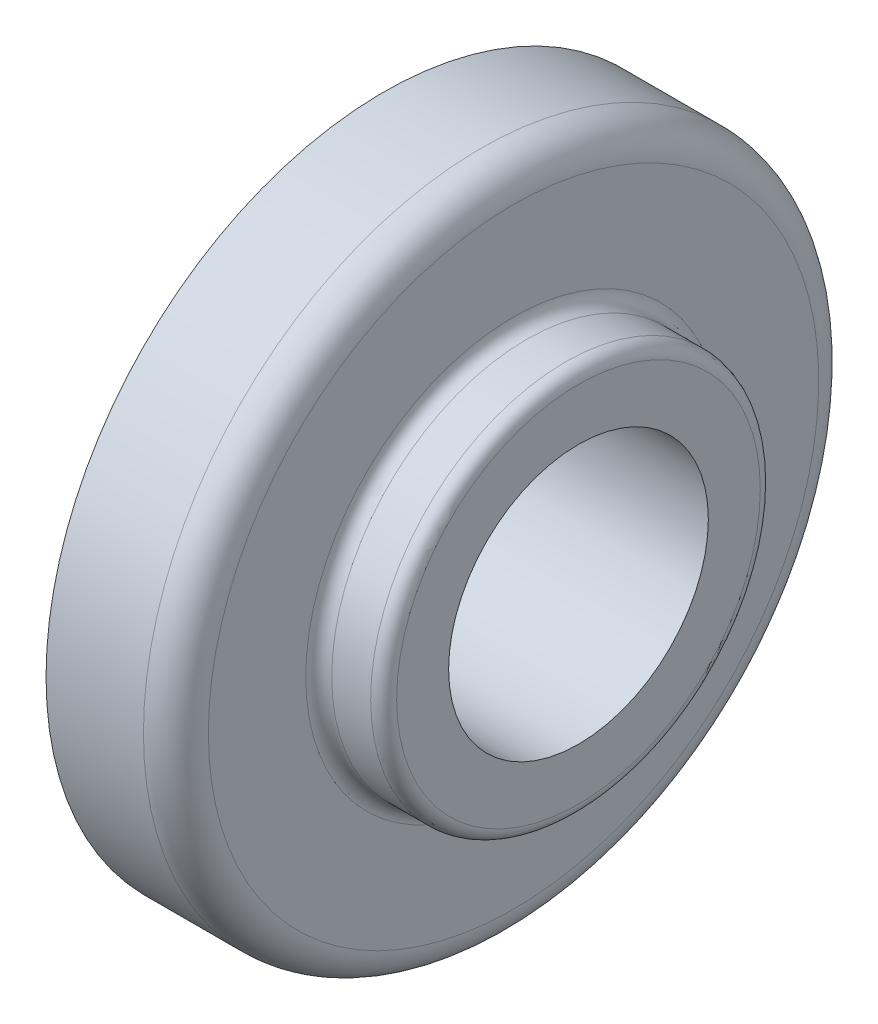
ISO-10303-21;
HEADER;
FILE_DESCRIPTION(('STEP AP214'),'2;1');
FILE_NAME('part.step','',(''),(''),'','','');
FILE_SCHEMA(('AUTOMOTIVE_DESIGN { 1 0 10303 214 1 1 1 1 }'));
ENDSEC;
DATA;
#1=APPLICATION_CONTEXT('core data for automotive mechanical design processes');
#2=APPLICATION_PROTOCOL_DEFINITION('international standard','automotive_design',2000,#1);
#3=PRODUCT_CONTEXT('',#1,'mechanical');
#4=PRODUCT('Part','Part','',(#3));
#5=PRODUCT_RELATED_PRODUCT_CATEGORY('part','',(#4));
#6=PRODUCT_DEFINITION_FORMATION('','',#4);
#7=PRODUCT_DEFINITION_CONTEXT('part definition',#1,'design');
#8=PRODUCT_DEFINITION('design','',#6,#7);
#9=PRODUCT_DEFINITION_SHAPE('','',#8);
#10=(LENGTH_UNIT() NAMED_UNIT(*) SI_UNIT(.MILLI.,.METRE.));
#11=(NAMED_UNIT(*) PLANE_ANGLE_UNIT() SI_UNIT($,.RADIAN.));
#12=(NAMED_UNIT(*) SI_UNIT($,.STERADIAN.) SOLID_ANGLE_UNIT());
#13=UNCERTAINTY_MEASURE_WITH_UNIT(LENGTH_MEASURE(1.E-05),#10,'distance_accuracy_value','');
#14=(GEOMETRIC_REPRESENTATION_CONTEXT(3) GLOBAL_UNCERTAINTY_ASSIGNED_CONTEXT((#13)) GLOBAL_UNIT_ASSIGNED_CONTEXT((#10,
#11,#12)) REPRESENTATION_CONTEXT('',''));
#15=CARTESIAN_POINT('',(0.,0.,0.));
#16=DIRECTION('',(0.,0.,1.));
#17=DIRECTION('',(1.,0.,0.));
#18=AXIS2_PLACEMENT_3D('',#15,#16,#17);
#19=CARTESIAN_POINT('',(-2.81819386738687,0.,7.32730405520585));
#20=DIRECTION('',(1.,0.,0.));
#21=DIRECTION('',(0.,0.,-1.));
#22=AXIS2_PLACEMENT_3D('',#19,#20,#21);
#23=PLANE('',#22);
#24=CARTESIAN_POINT('',(-2.81819386738687,0.,7.32730405520585));
#25=DIRECTION('',(1.,0.,0.));
#26=DIRECTION('',(0.,0.,-1.));
#27=AXIS2_PLACEMENT_3D('',#24,#25,#26);
#28=CIRCLE('',#27,10.);
#29=CARTESIAN_POINT('',(-2.81819386738687,0.,-2.67269594479415));
#30=VERTEX_POINT('',#29);
#31=EDGE_CURVE('E58',#30,#30,#28,.T.);
#32=ORIENTED_EDGE('',*,*,#31,.T.);
#33=EDGE_LOOP('',(#32));
#34=FACE_BOUND('',#33,.T.);
#35=CARTESIAN_POINT('',(-2.81819386738687,0.,7.32730405520585));
#36=DIRECTION('',(-1.,0.,0.));
#37=DIRECTION('',(0.,0.,1.));
#38=AXIS2_PLACEMENT_3D('',#35,#36,#37);
#39=CIRCLE('',#38,26.);
#40=CARTESIAN_POINT('',(-2.81819386738687,0.,33.3273040552059));
#41=VERTEX_POINT('',#40);
#42=EDGE_CURVE('E10',#41,#41,#39,.T.);
#43=ORIENTED_EDGE('',*,*,#42,.T.);
#44=EDGE_LOOP('',(#43));
#45=FACE_BOUND('',#44,.T.);
#46=ADVANCED_FACE('F30',(#34,#45),#23,.F.);
#47=CARTESIAN_POINT('',(-2.81819386738687,0.,7.32730405520585));
#48=DIRECTION('',(-1.,0.,0.));
#49=DIRECTION('',(0.,0.,1.));
#50=AXIS2_PLACEMENT_3D('',#47,#48,#49);
#51=CYLINDRICAL_SURFACE('',#50,26.);
#52=ORIENTED_EDGE('',*,*,#42,.F.);
#53=EDGE_LOOP('',(#52));
#54=FACE_BOUND('',#53,.T.);
#55=CARTESIAN_POINT('',(4.68180613261313,0.,7.32730405520585));
#56=DIRECTION('',(-1.,0.,0.));
#57=DIRECTION('',(0.,0.,1.));
#58=AXIS2_PLACEMENT_3D('',#55,#56,#57);
#59=CIRCLE('',#58,26.);
#60=CARTESIAN_POINT('',(4.68180613261313,0.,33.3273040552059));
#61=VERTEX_POINT('',#60);
#62=EDGE_CURVE('E36',#61,#61,#59,.T.);
#63=ORIENTED_EDGE('',*,*,#62,.T.);
#64=EDGE_LOOP('',(#63));
#65=FACE_BOUND('',#64,.T.);
#66=ADVANCED_FACE('F91',(#54,#65),#51,.T.);
#67=CARTESIAN_POINT('',(4.68180613261313,0.,7.32730405520585));
#68=DIRECTION('',(-1.,0.,0.));
#69=DIRECTION('',(0.,0.,1.));
#70=AXIS2_PLACEMENT_3D('',#67,#68,#69);
#71=TOROIDAL_SURFACE('',#70,23.5,2.5);
#72=ORIENTED_EDGE('',*,*,#62,.F.);
#73=EDGE_LOOP('',(#72));
#74=FACE_BOUND('',#73,.T.);
#75=CARTESIAN_POINT('',(7.18180613261313,0.,7.32730405520585));
#76=DIRECTION('',(-1.,0.,0.));
#77=DIRECTION('',(0.,0.,1.));
#78=AXIS2_PLACEMENT_3D('',#75,#76,#77);
#79=CIRCLE('',#78,23.5);
#80=CARTESIAN_POINT('',(7.18180613261313,0.,30.8273040552059));
#81=VERTEX_POINT('',#80);
#82=EDGE_CURVE('E40',#81,#81,#79,.T.);
#83=ORIENTED_EDGE('',*,*,#82,.T.);
#84=EDGE_LOOP('',(#83));
#85=FACE_BOUND('',#84,.T.);
#86=ADVANCED_FACE('F95',(#74,#85),#71,.T.);
#87=CARTESIAN_POINT('',(7.18180613261313,0.,-8.67269594479415));
#88=DIRECTION('',(-1.,0.,0.));
#89=DIRECTION('',(0.,0.,1.));
#90=AXIS2_PLACEMENT_3D('',#87,#88,#89);
#91=PLANE('',#90);
#92=ORIENTED_EDGE('',*,*,#82,.F.);
#93=EDGE_LOOP('',(#92));
#94=FACE_BOUND('',#93,.T.);
#95=CARTESIAN_POINT('',(7.18180613261313,0.,7.32730405520585));
#96=DIRECTION('',(-1.,0.,0.));
#97=DIRECTION('',(0.,0.,1.));
#98=AXIS2_PLACEMENT_3D('',#95,#96,#97);
#99=CIRCLE('',#98,16.);
#100=CARTESIAN_POINT('',(7.18180613261313,0.,23.3273040552059));
#101=VERTEX_POINT('',#100);
#102=EDGE_CURVE('E44',#101,#101,#99,.T.);
#103=ORIENTED_EDGE('',*,*,#102,.T.);
#104=EDGE_LOOP('',(#103));
#105=FACE_BOUND('',#104,.T.);
#106=ADVANCED_FACE('F100',(#94,#105),#91,.F.);
#107=CARTESIAN_POINT('',(8.18180613261313,0.,7.32730405520585));
#108=DIRECTION('',(-1.,0.,0.));
#109=DIRECTION('',(0.,0.,1.));
#110=AXIS2_PLACEMENT_3D('',#107,#108,#109);
#111=TOROIDAL_SURFACE('',#110,16.,1.);
#112=ORIENTED_EDGE('',*,*,#102,.F.);
#113=EDGE_LOOP('',(#112));
#114=FACE_BOUND('',#113,.T.);
#115=CARTESIAN_POINT('',(8.18180613261314,0.,7.32730405520585));
#116=DIRECTION('',(-1.,0.,0.));
#117=DIRECTION('',(0.,0.,1.));
#118=AXIS2_PLACEMENT_3D('',#115,#116,#117);
#119=CIRCLE('',#118,15.);
#120=CARTESIAN_POINT('',(8.18180613261314,0.,22.3273040552059));
#121=VERTEX_POINT('',#120);
#122=EDGE_CURVE('E49',#121,#121,#119,.T.);
#123=ORIENTED_EDGE('',*,*,#122,.T.);
#124=EDGE_LOOP('',(#123));
#125=FACE_BOUND('',#124,.T.);
#126=ADVANCED_FACE('F86',(#114,#125),#111,.F.);
#127=CARTESIAN_POINT('',(-2.81819386738687,0.,7.32730405520585));
#128=DIRECTION('',(-1.,0.,0.));
#129=DIRECTION('',(0.,0.,1.));
#130=AXIS2_PLACEMENT_3D('',#127,#128,#129);
#131=CYLINDRICAL_SURFACE('',#130,15.);
#132=ORIENTED_EDGE('',*,*,#122,.F.);
#133=EDGE_LOOP('',(#132));
#134=FACE_BOUND('',#133,.T.);
#135=CARTESIAN_POINT('',(11.1818061326131,0.,7.32730405520585));
#136=DIRECTION('',(-1.,0.,0.));
#137=DIRECTION('',(0.,0.,1.));
#138=AXIS2_PLACEMENT_3D('',#135,#136,#137);
#139=CIRCLE('',#138,15.);
#140=CARTESIAN_POINT('',(11.1818061326131,0.,22.3273040552059));
#141=VERTEX_POINT('',#140);
#142=EDGE_CURVE('E52',#141,#141,#139,.T.);
#143=ORIENTED_EDGE('',*,*,#142,.T.);
#144=EDGE_LOOP('',(#143));
#145=FACE_BOUND('',#144,.T.);
#146=ADVANCED_FACE('F80',(#134,#145),#131,.T.);
#147=CARTESIAN_POINT('',(11.1818061326131,0.,7.32730405520585));
#148=DIRECTION('',(-1.,0.,0.));
#149=DIRECTION('',(0.,0.,1.));
#150=AXIS2_PLACEMENT_3D('',#147,#148,#149);
#151=TOROIDAL_SURFACE('',#150,14.,1.);
#152=ORIENTED_EDGE('',*,*,#142,.F.);
#153=EDGE_LOOP('',(#152));
#154=FACE_BOUND('',#153,.T.);
#155=CARTESIAN_POINT('',(12.1818061326131,0.,7.32730405520585));
#156=DIRECTION('',(-1.,0.,0.));
#157=DIRECTION('',(0.,0.,1.));
#158=AXIS2_PLACEMENT_3D('',#155,#156,#157);
#159=CIRCLE('',#158,14.);
#160=CARTESIAN_POINT('',(12.1818061326131,0.,21.3273040552059));
#161=VERTEX_POINT('',#160);
#162=EDGE_CURVE('E55',#161,#161,#159,.T.);
#163=ORIENTED_EDGE('',*,*,#162,.T.);
#164=EDGE_LOOP('',(#163));
#165=FACE_BOUND('',#164,.T.);
#166=ADVANCED_FACE('F75',(#154,#165),#151,.T.);
#167=CARTESIAN_POINT('',(12.1818061326131,0.,7.32730405520585));
#168=DIRECTION('',(-1.,0.,0.));
#169=DIRECTION('',(0.,0.,1.));
#170=AXIS2_PLACEMENT_3D('',#167,#168,#169);
#171=PLANE('',#170);
#172=CARTESIAN_POINT('',(12.1818061326131,0.,7.32730405520585));
#173=DIRECTION('',(1.,0.,0.));
#174=DIRECTION('',(0.,0.,-1.));
#175=AXIS2_PLACEMENT_3D('',#172,#173,#174);
#176=CIRCLE('',#175,10.);
#177=CARTESIAN_POINT('',(12.1818061326131,0.,-2.67269594479415));
#178=VERTEX_POINT('',#177);
#179=EDGE_CURVE('E59',#178,#178,#176,.T.);
#180=ORIENTED_EDGE('',*,*,#179,.F.);
#181=EDGE_LOOP('',(#180));
#182=FACE_BOUND('',#181,.T.);
#183=ORIENTED_EDGE('',*,*,#162,.F.);
#184=EDGE_LOOP('',(#183));
#185=FACE_BOUND('',#184,.T.);
#186=ADVANCED_FACE('F69',(#182,#185),#171,.F.);
#187=CARTESIAN_POINT('',(-2.81819386738687,0.,7.32730405520585));
#188=DIRECTION('',(1.,0.,0.));
#189=DIRECTION('',(0.,0.,-1.));
#190=AXIS2_PLACEMENT_3D('',#187,#188,#189);
#191=CYLINDRICAL_SURFACE('',#190,10.);
#192=ORIENTED_EDGE('',*,*,#31,.F.);
#193=EDGE_LOOP('',(#192));
#194=FACE_BOUND('',#193,.T.);
#195=ORIENTED_EDGE('',*,*,#179,.T.);
#196=EDGE_LOOP('',(#195));
#197=FACE_BOUND('',#196,.T.);
#198=ADVANCED_FACE('F66',(#194,#197),#191,.F.);
#199=CLOSED_SHELL('',(#46,#66,#86,#106,#126,#146,#166,#186,#198));
#200=MANIFOLD_SOLID_BREP('B2',#199);
#201=ADVANCED_BREP_SHAPE_REPRESENTATION('',(#18,#200),#14);
#202=SHAPE_DEFINITION_REPRESENTATION(#9,#201);
ENDSEC;
END-ISO-10303-21;
